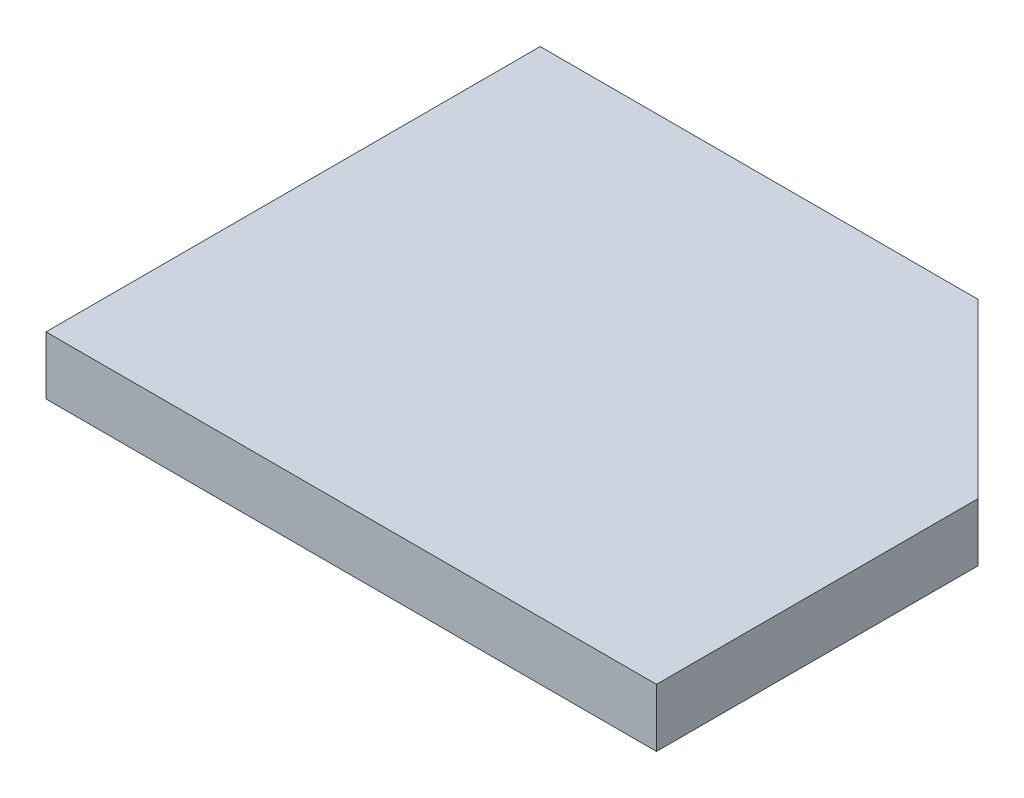
ISO-10303-21;
HEADER;
FILE_DESCRIPTION(('STEP AP214'),'2;1');
FILE_NAME('part.step','',(''),(''),'','','');
FILE_SCHEMA(('AUTOMOTIVE_DESIGN { 1 0 10303 214 1 1 1 1 }'));
ENDSEC;
DATA;
#1=APPLICATION_CONTEXT('core data for automotive mechanical design processes');
#2=APPLICATION_PROTOCOL_DEFINITION('international standard','automotive_design',2000,#1);
#3=PRODUCT_CONTEXT('',#1,'mechanical');
#4=PRODUCT('Part','Part','',(#3));
#5=PRODUCT_RELATED_PRODUCT_CATEGORY('part','',(#4));
#6=PRODUCT_DEFINITION_FORMATION('','',#4);
#7=PRODUCT_DEFINITION_CONTEXT('part definition',#1,'design');
#8=PRODUCT_DEFINITION('design','',#6,#7);
#9=PRODUCT_DEFINITION_SHAPE('','',#8);
#10=(LENGTH_UNIT() NAMED_UNIT(*) SI_UNIT(.MILLI.,.METRE.));
#11=(NAMED_UNIT(*) PLANE_ANGLE_UNIT() SI_UNIT($,.RADIAN.));
#12=(NAMED_UNIT(*) SI_UNIT($,.STERADIAN.) SOLID_ANGLE_UNIT());
#13=UNCERTAINTY_MEASURE_WITH_UNIT(LENGTH_MEASURE(1.E-05),#10,'distance_accuracy_value','');
#14=(GEOMETRIC_REPRESENTATION_CONTEXT(3) GLOBAL_UNCERTAINTY_ASSIGNED_CONTEXT((#13)) GLOBAL_UNIT_ASSIGNED_CONTEXT((#10,
#11,#12)) REPRESENTATION_CONTEXT('',''));
#15=CARTESIAN_POINT('',(0.,0.,0.));
#16=DIRECTION('',(0.,0.,1.));
#17=DIRECTION('',(1.,0.,0.));
#18=AXIS2_PLACEMENT_3D('',#15,#16,#17);
#19=CARTESIAN_POINT('',(34.1413834417471,10.,-19.7960633647153));
#20=DIRECTION('',(0.,0.,1.));
#21=DIRECTION('',(1.,0.,0.));
#22=AXIS2_PLACEMENT_3D('',#19,#20,#21);
#23=PLANE('',#22);
#24=DIRECTION('',(-1.,0.,0.));
#25=VECTOR('',#24,1.);
#26=CARTESIAN_POINT('',(34.1413834417471,0.,-19.7960633647153));
#27=LINE('',#26,#25);
#28=CARTESIAN_POINT('',(34.1413834417471,0.,-19.7960633647153));
#29=VERTEX_POINT('',#28);
#30=CARTESIAN_POINT('',(-41.1601317484179,0.,-19.7960633647153));
#31=VERTEX_POINT('',#30);
#32=EDGE_CURVE('E107',#29,#31,#27,.T.);
#33=ORIENTED_EDGE('',*,*,#32,.T.);
#34=DIRECTION('',(0.,-1.,0.));
#35=VECTOR('',#34,1.);
#36=CARTESIAN_POINT('',(-41.1601317484179,10.,-19.7960633647153));
#37=LINE('',#36,#35);
#38=CARTESIAN_POINT('',(-41.1601317484179,10.,-19.7960633647153));
#39=VERTEX_POINT('',#38);
#40=EDGE_CURVE('E11',#39,#31,#37,.T.);
#41=ORIENTED_EDGE('',*,*,#40,.F.);
#42=DIRECTION('',(-1.,0.,0.));
#43=VECTOR('',#42,1.);
#44=CARTESIAN_POINT('',(34.1413834417471,10.,-19.7960633647153));
#45=LINE('',#44,#43);
#46=CARTESIAN_POINT('',(34.1413834417471,10.,-19.7960633647153));
#47=VERTEX_POINT('',#46);
#48=EDGE_CURVE('E115',#47,#39,#45,.T.);
#49=ORIENTED_EDGE('',*,*,#48,.F.);
#50=DIRECTION('',(0.,-1.,0.));
#51=VECTOR('',#50,1.);
#52=CARTESIAN_POINT('',(34.1413834417471,10.,-19.7960633647153));
#53=LINE('',#52,#51);
#54=EDGE_CURVE('E103',#47,#29,#53,.T.);
#55=ORIENTED_EDGE('',*,*,#54,.T.);
#56=EDGE_LOOP('',(#33,#41,#49,#55));
#57=FACE_BOUND('',#56,.T.);
#58=ADVANCED_FACE('F33',(#57),#23,.F.);
#59=CARTESIAN_POINT('',(-41.1601317484179,10.,-19.7960633647153));
#60=DIRECTION('',(1.,0.,0.));
#61=DIRECTION('',(0.,0.,-1.));
#62=AXIS2_PLACEMENT_3D('',#59,#60,#61);
#63=PLANE('',#62);
#64=DIRECTION('',(0.,0.,1.));
#65=VECTOR('',#64,1.);
#66=CARTESIAN_POINT('',(-41.1601317484179,0.,-19.7960633647153));
#67=LINE('',#66,#65);
#68=CARTESIAN_POINT('',(-41.1601317484179,0.,65.2039366352847));
#69=VERTEX_POINT('',#68);
#70=EDGE_CURVE('E110',#31,#69,#67,.T.);
#71=ORIENTED_EDGE('',*,*,#70,.T.);
#72=DIRECTION('',(0.,-1.,0.));
#73=VECTOR('',#72,1.);
#74=CARTESIAN_POINT('',(-41.1601317484179,10.,65.2039366352847));
#75=LINE('',#74,#73);
#76=CARTESIAN_POINT('',(-41.1601317484179,10.,65.2039366352847));
#77=VERTEX_POINT('',#76);
#78=EDGE_CURVE('E41',#77,#69,#75,.T.);
#79=ORIENTED_EDGE('',*,*,#78,.F.);
#80=DIRECTION('',(0.,0.,1.));
#81=VECTOR('',#80,1.);
#82=CARTESIAN_POINT('',(-41.1601317484179,10.,-19.7960633647153));
#83=LINE('',#82,#81);
#84=EDGE_CURVE('E83',#39,#77,#83,.T.);
#85=ORIENTED_EDGE('',*,*,#84,.F.);
#86=ORIENTED_EDGE('',*,*,#40,.T.);
#87=EDGE_LOOP('',(#71,#79,#85,#86));
#88=FACE_BOUND('',#87,.T.);
#89=ADVANCED_FACE('F134',(#88),#63,.F.);
#90=CARTESIAN_POINT('',(-41.1601317484179,10.,65.2039366352847));
#91=DIRECTION('',(0.,0.,-1.));
#92=DIRECTION('',(-1.,0.,0.));
#93=AXIS2_PLACEMENT_3D('',#90,#91,#92);
#94=PLANE('',#93);
#95=DIRECTION('',(1.,0.,0.));
#96=VECTOR('',#95,1.);
#97=CARTESIAN_POINT('',(-41.1601317484179,0.,65.2039366352847));
#98=LINE('',#97,#96);
#99=CARTESIAN_POINT('',(63.8398682515821,0.,65.2039366352847));
#100=VERTEX_POINT('',#99);
#101=EDGE_CURVE('E98',#69,#100,#98,.T.);
#102=ORIENTED_EDGE('',*,*,#101,.T.);
#103=DIRECTION('',(0.,-1.,0.));
#104=VECTOR('',#103,1.);
#105=CARTESIAN_POINT('',(63.8398682515821,10.,65.2039366352847));
#106=LINE('',#105,#104);
#107=CARTESIAN_POINT('',(63.8398682515821,10.,65.2039366352847));
#108=VERTEX_POINT('',#107);
#109=EDGE_CURVE('E95',#108,#100,#106,.T.);
#110=ORIENTED_EDGE('',*,*,#109,.F.);
#111=DIRECTION('',(1.,0.,0.));
#112=VECTOR('',#111,1.);
#113=CARTESIAN_POINT('',(-41.1601317484179,10.,65.2039366352847));
#114=LINE('',#113,#112);
#115=EDGE_CURVE('E87',#77,#108,#114,.T.);
#116=ORIENTED_EDGE('',*,*,#115,.F.);
#117=ORIENTED_EDGE('',*,*,#78,.T.);
#118=EDGE_LOOP('',(#102,#110,#116,#117));
#119=FACE_BOUND('',#118,.T.);
#120=ADVANCED_FACE('F96',(#119),#94,.F.);
#121=CARTESIAN_POINT('',(63.8398682515821,10.,65.2039366352847));
#122=DIRECTION('',(-1.,0.,0.));
#123=DIRECTION('',(0.,0.,1.));
#124=AXIS2_PLACEMENT_3D('',#121,#122,#123);
#125=PLANE('',#124);
#126=DIRECTION('',(0.,0.,-1.));
#127=VECTOR('',#126,1.);
#128=CARTESIAN_POINT('',(63.8398682515821,0.,65.2039366352847));
#129=LINE('',#128,#127);
#130=CARTESIAN_POINT('',(63.8398682515821,0.,9.90242144511974));
#131=VERTEX_POINT('',#130);
#132=EDGE_CURVE('E69',#100,#131,#129,.T.);
#133=ORIENTED_EDGE('',*,*,#132,.T.);
#134=DIRECTION('',(0.,-1.,0.));
#135=VECTOR('',#134,1.);
#136=CARTESIAN_POINT('',(63.8398682515821,10.,9.90242144511974));
#137=LINE('',#136,#135);
#138=CARTESIAN_POINT('',(63.8398682515821,10.,9.90242144511974));
#139=VERTEX_POINT('',#138);
#140=EDGE_CURVE('E99',#139,#131,#137,.T.);
#141=ORIENTED_EDGE('',*,*,#140,.F.);
#142=DIRECTION('',(0.,0.,-1.));
#143=VECTOR('',#142,1.);
#144=CARTESIAN_POINT('',(63.8398682515821,10.,65.2039366352847));
#145=LINE('',#144,#143);
#146=EDGE_CURVE('E91',#108,#139,#145,.T.);
#147=ORIENTED_EDGE('',*,*,#146,.F.);
#148=ORIENTED_EDGE('',*,*,#109,.T.);
#149=EDGE_LOOP('',(#133,#141,#147,#148));
#150=FACE_BOUND('',#149,.T.);
#151=ADVANCED_FACE('F101',(#150),#125,.F.);
#152=CARTESIAN_POINT('',(63.8398682515821,10.,9.90242144511974));
#153=DIRECTION('',(-0.707106781186549,0.,0.707106781186546));
#154=DIRECTION('',(0.707106781186546,0.,0.707106781186549));
#155=AXIS2_PLACEMENT_3D('',#152,#153,#154);
#156=PLANE('',#155);
#157=DIRECTION('',(-0.707106781186546,0.,-0.707106781186549));
#158=VECTOR('',#157,1.);
#159=CARTESIAN_POINT('',(63.8398682515821,0.,9.90242144511974));
#160=LINE('',#159,#158);
#161=EDGE_CURVE('E75',#131,#29,#160,.T.);
#162=ORIENTED_EDGE('',*,*,#161,.T.);
#163=ORIENTED_EDGE('',*,*,#54,.F.);
#164=DIRECTION('',(-0.707106781186546,0.,-0.707106781186549));
#165=VECTOR('',#164,1.);
#166=CARTESIAN_POINT('',(63.8398682515821,10.,9.90242144511974));
#167=LINE('',#166,#165);
#168=EDGE_CURVE('E49',#139,#47,#167,.T.);
#169=ORIENTED_EDGE('',*,*,#168,.F.);
#170=ORIENTED_EDGE('',*,*,#140,.T.);
#171=EDGE_LOOP('',(#162,#163,#169,#170));
#172=FACE_BOUND('',#171,.T.);
#173=ADVANCED_FACE('F123',(#172),#156,.F.);
#174=CARTESIAN_POINT('',(0.,10.,0.));
#175=DIRECTION('',(0.,1.,0.));
#176=DIRECTION('',(0.,0.,1.));
#177=AXIS2_PLACEMENT_3D('',#174,#175,#176);
#178=PLANE('',#177);
#179=ORIENTED_EDGE('',*,*,#48,.T.);
#180=ORIENTED_EDGE('',*,*,#84,.T.);
#181=ORIENTED_EDGE('',*,*,#115,.T.);
#182=ORIENTED_EDGE('',*,*,#146,.T.);
#183=ORIENTED_EDGE('',*,*,#168,.T.);
#184=EDGE_LOOP('',(#179,#180,#181,#182,#183));
#185=FACE_BOUND('',#184,.T.);
#186=ADVANCED_FACE('F89',(#185),#178,.T.);
#187=CARTESIAN_POINT('',(0.,0.,0.));
#188=DIRECTION('',(0.,1.,0.));
#189=DIRECTION('',(0.,0.,1.));
#190=AXIS2_PLACEMENT_3D('',#187,#188,#189);
#191=PLANE('',#190);
#192=ORIENTED_EDGE('',*,*,#32,.F.);
#193=ORIENTED_EDGE('',*,*,#161,.F.);
#194=ORIENTED_EDGE('',*,*,#132,.F.);
#195=ORIENTED_EDGE('',*,*,#101,.F.);
#196=ORIENTED_EDGE('',*,*,#70,.F.);
#197=EDGE_LOOP('',(#192,#193,#194,#195,#196));
#198=FACE_BOUND('',#197,.T.);
#199=ADVANCED_FACE('F119',(#198),#191,.F.);
#200=CLOSED_SHELL('',(#58,#89,#120,#151,#173,#186,#199));
#201=MANIFOLD_SOLID_BREP('B2',#200);
#202=ADVANCED_BREP_SHAPE_REPRESENTATION('',(#18,#201),#14);
#203=SHAPE_DEFINITION_REPRESENTATION(#9,#202);
ENDSEC;
END-ISO-10303-21;
